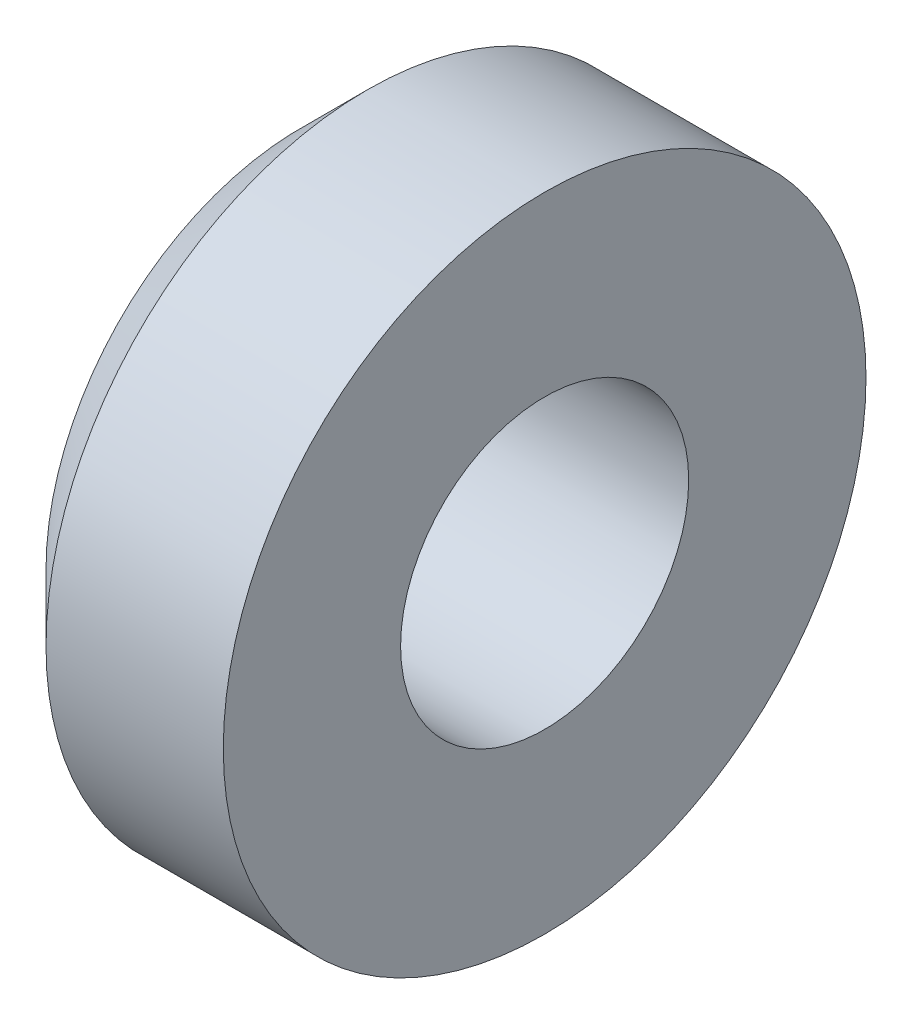
ISO-10303-21;
HEADER;
FILE_DESCRIPTION(('STEP AP214'),'2;1');
FILE_NAME('part.step','',(''),(''),'','','');
FILE_SCHEMA(('AUTOMOTIVE_DESIGN { 1 0 10303 214 1 1 1 1 }'));
ENDSEC;
DATA;
#1=APPLICATION_CONTEXT('core data for automotive mechanical design processes');
#2=APPLICATION_PROTOCOL_DEFINITION('international standard','automotive_design',2000,#1);
#3=PRODUCT_CONTEXT('',#1,'mechanical');
#4=PRODUCT('Part','Part','',(#3));
#5=PRODUCT_RELATED_PRODUCT_CATEGORY('part','',(#4));
#6=PRODUCT_DEFINITION_FORMATION('','',#4);
#7=PRODUCT_DEFINITION_CONTEXT('part definition',#1,'design');
#8=PRODUCT_DEFINITION('design','',#6,#7);
#9=PRODUCT_DEFINITION_SHAPE('','',#8);
#10=(LENGTH_UNIT() NAMED_UNIT(*) SI_UNIT(.MILLI.,.METRE.));
#11=(NAMED_UNIT(*) PLANE_ANGLE_UNIT() SI_UNIT($,.RADIAN.));
#12=(NAMED_UNIT(*) SI_UNIT($,.STERADIAN.) SOLID_ANGLE_UNIT());
#13=UNCERTAINTY_MEASURE_WITH_UNIT(LENGTH_MEASURE(1.E-05),#10,'distance_accuracy_value','');
#14=(GEOMETRIC_REPRESENTATION_CONTEXT(3) GLOBAL_UNCERTAINTY_ASSIGNED_CONTEXT((#13)) GLOBAL_UNIT_ASSIGNED_CONTEXT((#10,
#11,#12)) REPRESENTATION_CONTEXT('',''));
#15=CARTESIAN_POINT('',(0.,0.,0.));
#16=DIRECTION('',(0.,0.,1.));
#17=DIRECTION('',(1.,0.,0.));
#18=AXIS2_PLACEMENT_3D('',#15,#16,#17);
#19=CARTESIAN_POINT('',(0.,2.875,0.));
#20=DIRECTION('',(1.,0.,0.));
#21=DIRECTION('',(0.,0.,-1.));
#22=AXIS2_PLACEMENT_3D('',#19,#20,#21);
#23=PLANE('',#22);
#24=CARTESIAN_POINT('',(0.,0.,0.));
#25=DIRECTION('',(-1.,0.,0.));
#26=DIRECTION('',(0.,0.,1.));
#27=AXIS2_PLACEMENT_3D('',#24,#25,#26);
#28=CIRCLE('',#27,1.625);
#29=CARTESIAN_POINT('',(0.,0.,1.625));
#30=VERTEX_POINT('',#29);
#31=EDGE_CURVE('E10',#30,#30,#28,.T.);
#32=ORIENTED_EDGE('',*,*,#31,.F.);
#33=EDGE_LOOP('',(#32));
#34=FACE_BOUND('',#33,.T.);
#35=CARTESIAN_POINT('',(0.,0.,0.));
#36=DIRECTION('',(-1.,0.,0.));
#37=DIRECTION('',(0.,0.,1.));
#38=AXIS2_PLACEMENT_3D('',#35,#36,#37);
#39=CIRCLE('',#38,2.875);
#40=CARTESIAN_POINT('',(0.,0.,2.875));
#41=VERTEX_POINT('',#40);
#42=EDGE_CURVE('E49',#41,#41,#39,.T.);
#43=ORIENTED_EDGE('',*,*,#42,.T.);
#44=EDGE_LOOP('',(#43));
#45=FACE_BOUND('',#44,.T.);
#46=ADVANCED_FACE('F30',(#34,#45),#23,.F.);
#47=CARTESIAN_POINT('',(-4.99495925674834,0.,0.));
#48=DIRECTION('',(-1.,0.,0.));
#49=DIRECTION('',(0.,0.,1.));
#50=AXIS2_PLACEMENT_3D('',#47,#48,#49);
#51=CYLINDRICAL_SURFACE('',#50,1.625);
#52=CARTESIAN_POINT('',(2.75000000000001,0.,0.));
#53=DIRECTION('',(-1.,0.,0.));
#54=DIRECTION('',(0.,0.,1.));
#55=AXIS2_PLACEMENT_3D('',#52,#53,#54);
#56=CIRCLE('',#55,1.62499999999999);
#57=CARTESIAN_POINT('',(2.75000000000001,0.,1.62499999999999));
#58=VERTEX_POINT('',#57);
#59=EDGE_CURVE('E36',#58,#58,#56,.T.);
#60=ORIENTED_EDGE('',*,*,#59,.F.);
#61=EDGE_LOOP('',(#60));
#62=FACE_BOUND('',#61,.T.);
#63=ORIENTED_EDGE('',*,*,#31,.T.);
#64=EDGE_LOOP('',(#63));
#65=FACE_BOUND('',#64,.T.);
#66=ADVANCED_FACE('F68',(#62,#65),#51,.F.);
#67=CARTESIAN_POINT('',(2.75000000000001,1.62499999999999,0.));
#68=DIRECTION('',(-1.,0.,0.));
#69=DIRECTION('',(0.,0.,1.));
#70=AXIS2_PLACEMENT_3D('',#67,#68,#69);
#71=PLANE('',#70);
#72=CARTESIAN_POINT('',(2.75000000000001,0.,0.));
#73=DIRECTION('',(-1.,0.,0.));
#74=DIRECTION('',(0.,0.,1.));
#75=AXIS2_PLACEMENT_3D('',#72,#73,#74);
#76=CIRCLE('',#75,3.62499999999999);
#77=CARTESIAN_POINT('',(2.75000000000001,0.,3.62499999999999));
#78=VERTEX_POINT('',#77);
#79=EDGE_CURVE('E40',#78,#78,#76,.T.);
#80=ORIENTED_EDGE('',*,*,#79,.F.);
#81=EDGE_LOOP('',(#80));
#82=FACE_BOUND('',#81,.T.);
#83=ORIENTED_EDGE('',*,*,#59,.T.);
#84=EDGE_LOOP('',(#83));
#85=FACE_BOUND('',#84,.T.);
#86=ADVANCED_FACE('F63',(#82,#85),#71,.F.);
#87=CARTESIAN_POINT('',(-4.99495925674834,0.,0.));
#88=DIRECTION('',(-1.,0.,0.));
#89=DIRECTION('',(0.,0.,1.));
#90=AXIS2_PLACEMENT_3D('',#87,#88,#89);
#91=CYLINDRICAL_SURFACE('',#90,3.62499999999999);
#92=CARTESIAN_POINT('',(0.750000000000008,0.,0.));
#93=DIRECTION('',(-1.,0.,0.));
#94=DIRECTION('',(0.,0.,1.));
#95=AXIS2_PLACEMENT_3D('',#92,#93,#94);
#96=CIRCLE('',#95,3.62499999999999);
#97=CARTESIAN_POINT('',(0.750000000000008,0.,3.62499999999999));
#98=VERTEX_POINT('',#97);
#99=EDGE_CURVE('E44',#98,#98,#96,.T.);
#100=ORIENTED_EDGE('',*,*,#99,.F.);
#101=EDGE_LOOP('',(#100));
#102=FACE_BOUND('',#101,.T.);
#103=ORIENTED_EDGE('',*,*,#79,.T.);
#104=EDGE_LOOP('',(#103));
#105=FACE_BOUND('',#104,.T.);
#106=ADVANCED_FACE('F57',(#102,#105),#91,.T.);
#107=CARTESIAN_POINT('',(0.750000000000008,0.,0.));
#108=DIRECTION('',(1.,0.,0.));
#109=DIRECTION('',(0.,0.,-1.));
#110=AXIS2_PLACEMENT_3D('',#107,#108,#109);
#111=CONICAL_SURFACE('',#110,3.62499999999999,0.785398163397434);
#112=ORIENTED_EDGE('',*,*,#42,.F.);
#113=EDGE_LOOP('',(#112));
#114=FACE_BOUND('',#113,.T.);
#115=ORIENTED_EDGE('',*,*,#99,.T.);
#116=EDGE_LOOP('',(#115));
#117=FACE_BOUND('',#116,.T.);
#118=ADVANCED_FACE('F54',(#114,#117),#111,.T.);
#119=CLOSED_SHELL('',(#46,#66,#86,#106,#118));
#120=MANIFOLD_SOLID_BREP('B2',#119);
#121=ADVANCED_BREP_SHAPE_REPRESENTATION('',(#18,#120),#14);
#122=SHAPE_DEFINITION_REPRESENTATION(#9,#121);
ENDSEC;
END-ISO-10303-21;
